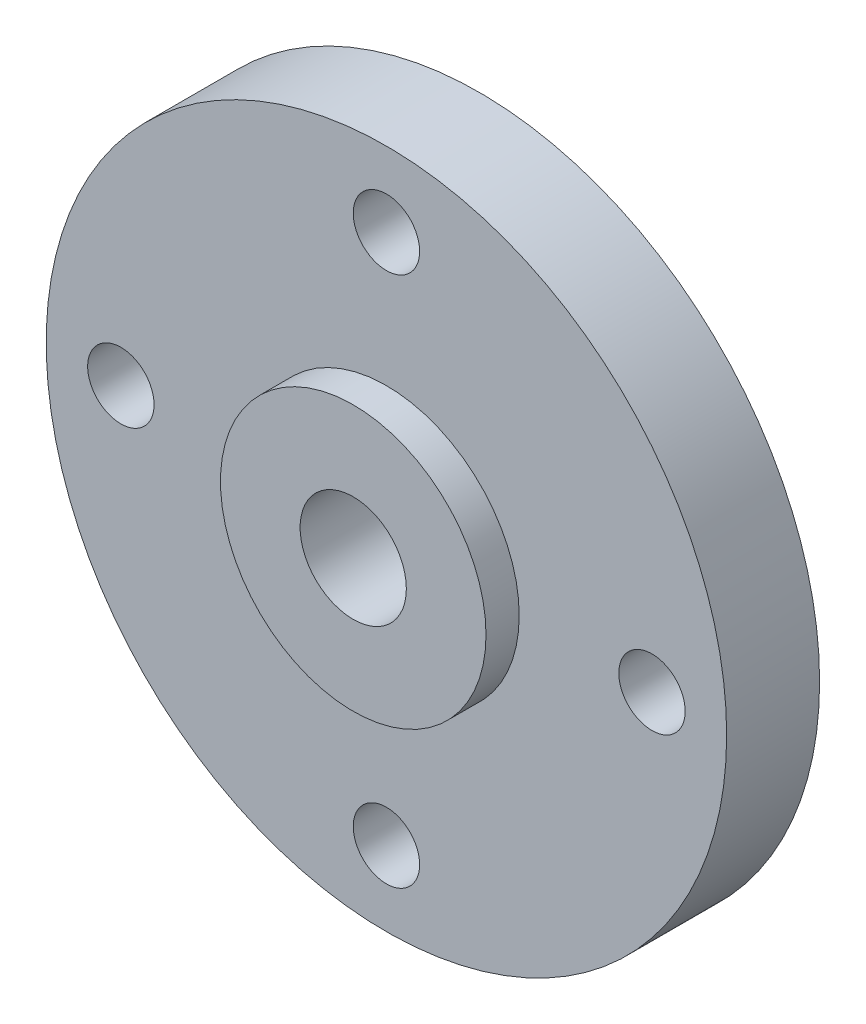
ISO-10303-21;
HEADER;
FILE_DESCRIPTION(('STEP AP214'),'2;1');
FILE_NAME('part.step','',(''),(''),'','','');
FILE_SCHEMA(('AUTOMOTIVE_DESIGN { 1 0 10303 214 1 1 1 1 }'));
ENDSEC;
DATA;
#1=APPLICATION_CONTEXT('core data for automotive mechanical design processes');
#2=APPLICATION_PROTOCOL_DEFINITION('international standard','automotive_design',2000,#1);
#3=PRODUCT_CONTEXT('',#1,'mechanical');
#4=PRODUCT('Part','Part','',(#3));
#5=PRODUCT_RELATED_PRODUCT_CATEGORY('part','',(#4));
#6=PRODUCT_DEFINITION_FORMATION('','',#4);
#7=PRODUCT_DEFINITION_CONTEXT('part definition',#1,'design');
#8=PRODUCT_DEFINITION('design','',#6,#7);
#9=PRODUCT_DEFINITION_SHAPE('','',#8);
#10=(LENGTH_UNIT() NAMED_UNIT(*) SI_UNIT(.MILLI.,.METRE.));
#11=(NAMED_UNIT(*) PLANE_ANGLE_UNIT() SI_UNIT($,.RADIAN.));
#12=(NAMED_UNIT(*) SI_UNIT($,.STERADIAN.) SOLID_ANGLE_UNIT());
#13=UNCERTAINTY_MEASURE_WITH_UNIT(LENGTH_MEASURE(1.E-05),#10,'distance_accuracy_value','');
#14=(GEOMETRIC_REPRESENTATION_CONTEXT(3) GLOBAL_UNCERTAINTY_ASSIGNED_CONTEXT((#13)) GLOBAL_UNIT_ASSIGNED_CONTEXT((#10,
#11,#12)) REPRESENTATION_CONTEXT('',''));
#15=CARTESIAN_POINT('',(0.,0.,0.));
#16=DIRECTION('',(0.,0.,1.));
#17=DIRECTION('',(1.,0.,0.));
#18=AXIS2_PLACEMENT_3D('',#15,#16,#17);
#19=CARTESIAN_POINT('',(0.,0.,2.8));
#20=DIRECTION('',(0.,0.,-1.));
#21=DIRECTION('',(-1.,0.,0.));
#22=AXIS2_PLACEMENT_3D('',#19,#20,#21);
#23=CYLINDRICAL_SURFACE('',#22,10.25);
#24=CARTESIAN_POINT('',(0.,0.,2.8));
#25=DIRECTION('',(0.,0.,1.));
#26=DIRECTION('',(1.,0.,0.));
#27=AXIS2_PLACEMENT_3D('',#24,#25,#26);
#28=CIRCLE('',#27,10.25);
#29=CARTESIAN_POINT('',(10.25,0.,2.8));
#30=VERTEX_POINT('',#29);
#31=EDGE_CURVE('E10',#30,#30,#28,.T.);
#32=ORIENTED_EDGE('',*,*,#31,.F.);
#33=EDGE_LOOP('',(#32));
#34=FACE_BOUND('',#33,.T.);
#35=CARTESIAN_POINT('',(0.,0.,0.));
#36=DIRECTION('',(0.,0.,1.));
#37=DIRECTION('',(1.,0.,0.));
#38=AXIS2_PLACEMENT_3D('',#35,#36,#37);
#39=CIRCLE('',#38,10.25);
#40=CARTESIAN_POINT('',(10.25,0.,0.));
#41=VERTEX_POINT('',#40);
#42=EDGE_CURVE('E39',#41,#41,#39,.T.);
#43=ORIENTED_EDGE('',*,*,#42,.T.);
#44=EDGE_LOOP('',(#43));
#45=FACE_BOUND('',#44,.T.);
#46=ADVANCED_FACE('F36',(#34,#45),#23,.T.);
#47=CARTESIAN_POINT('',(0.,0.,2.8));
#48=DIRECTION('',(0.,0.,1.));
#49=DIRECTION('',(1.,0.,0.));
#50=AXIS2_PLACEMENT_3D('',#47,#48,#49);
#51=PLANE('',#50);
#52=CARTESIAN_POINT('',(0.,8.,2.8));
#53=DIRECTION('',(0.,0.,1.));
#54=DIRECTION('',(1.,0.,0.));
#55=AXIS2_PLACEMENT_3D('',#52,#53,#54);
#56=CIRCLE('',#55,1.);
#57=CARTESIAN_POINT('',(1.,8.,2.8));
#58=VERTEX_POINT('',#57);
#59=EDGE_CURVE('E77',#58,#58,#56,.T.);
#60=ORIENTED_EDGE('',*,*,#59,.F.);
#61=EDGE_LOOP('',(#60));
#62=FACE_BOUND('',#61,.T.);
#63=CARTESIAN_POINT('',(-8.,0.,2.8));
#64=DIRECTION('',(0.,0.,1.));
#65=DIRECTION('',(1.,0.,0.));
#66=AXIS2_PLACEMENT_3D('',#63,#64,#65);
#67=CIRCLE('',#66,1.);
#68=CARTESIAN_POINT('',(-7.,0.,2.8));
#69=VERTEX_POINT('',#68);
#70=EDGE_CURVE('E71',#69,#69,#67,.T.);
#71=ORIENTED_EDGE('',*,*,#70,.F.);
#72=EDGE_LOOP('',(#71));
#73=FACE_BOUND('',#72,.T.);
#74=CARTESIAN_POINT('',(0.,-8.,2.8));
#75=DIRECTION('',(0.,0.,1.));
#76=DIRECTION('',(1.,0.,0.));
#77=AXIS2_PLACEMENT_3D('',#74,#75,#76);
#78=CIRCLE('',#77,1.);
#79=CARTESIAN_POINT('',(1.,-8.,2.8));
#80=VERTEX_POINT('',#79);
#81=EDGE_CURVE('E65',#80,#80,#78,.T.);
#82=ORIENTED_EDGE('',*,*,#81,.F.);
#83=EDGE_LOOP('',(#82));
#84=FACE_BOUND('',#83,.T.);
#85=CARTESIAN_POINT('',(8.,0.,2.8));
#86=DIRECTION('',(0.,0.,1.));
#87=DIRECTION('',(1.,0.,0.));
#88=AXIS2_PLACEMENT_3D('',#85,#86,#87);
#89=CIRCLE('',#88,1.);
#90=CARTESIAN_POINT('',(9.,0.,2.8));
#91=VERTEX_POINT('',#90);
#92=EDGE_CURVE('E59',#91,#91,#89,.T.);
#93=ORIENTED_EDGE('',*,*,#92,.F.);
#94=EDGE_LOOP('',(#93));
#95=FACE_BOUND('',#94,.T.);
#96=CARTESIAN_POINT('',(0.,0.,2.8));
#97=DIRECTION('',(0.,0.,1.));
#98=DIRECTION('',(1.,0.,0.));
#99=AXIS2_PLACEMENT_3D('',#96,#97,#98);
#100=CIRCLE('',#99,4.);
#101=CARTESIAN_POINT('',(4.,0.,2.8));
#102=VERTEX_POINT('',#101);
#103=EDGE_CURVE('E43',#102,#102,#100,.T.);
#104=ORIENTED_EDGE('',*,*,#103,.F.);
#105=EDGE_LOOP('',(#104));
#106=FACE_BOUND('',#105,.T.);
#107=ORIENTED_EDGE('',*,*,#31,.T.);
#108=EDGE_LOOP('',(#107));
#109=FACE_BOUND('',#108,.T.);
#110=ADVANCED_FACE('F93',(#62,#73,#84,#95,#106,#109),#51,.T.);
#111=CARTESIAN_POINT('',(0.,0.,0.));
#112=DIRECTION('',(0.,0.,1.));
#113=DIRECTION('',(1.,0.,0.));
#114=AXIS2_PLACEMENT_3D('',#111,#112,#113);
#115=PLANE('',#114);
#116=CARTESIAN_POINT('',(0.,8.,0.));
#117=DIRECTION('',(0.,0.,1.));
#118=DIRECTION('',(1.,0.,0.));
#119=AXIS2_PLACEMENT_3D('',#116,#117,#118);
#120=CIRCLE('',#119,1.);
#121=CARTESIAN_POINT('',(1.,8.,0.));
#122=VERTEX_POINT('',#121);
#123=EDGE_CURVE('E53',#122,#122,#120,.T.);
#124=ORIENTED_EDGE('',*,*,#123,.T.);
#125=EDGE_LOOP('',(#124));
#126=FACE_BOUND('',#125,.T.);
#127=CARTESIAN_POINT('',(-8.,0.,0.));
#128=DIRECTION('',(0.,0.,1.));
#129=DIRECTION('',(1.,0.,0.));
#130=AXIS2_PLACEMENT_3D('',#127,#128,#129);
#131=CIRCLE('',#130,1.);
#132=CARTESIAN_POINT('',(-7.,0.,0.));
#133=VERTEX_POINT('',#132);
#134=EDGE_CURVE('E74',#133,#133,#131,.T.);
#135=ORIENTED_EDGE('',*,*,#134,.T.);
#136=EDGE_LOOP('',(#135));
#137=FACE_BOUND('',#136,.T.);
#138=CARTESIAN_POINT('',(0.,-8.,0.));
#139=DIRECTION('',(0.,0.,1.));
#140=DIRECTION('',(1.,0.,0.));
#141=AXIS2_PLACEMENT_3D('',#138,#139,#140);
#142=CIRCLE('',#141,1.);
#143=CARTESIAN_POINT('',(1.,-8.,0.));
#144=VERTEX_POINT('',#143);
#145=EDGE_CURVE('E68',#144,#144,#142,.T.);
#146=ORIENTED_EDGE('',*,*,#145,.T.);
#147=EDGE_LOOP('',(#146));
#148=FACE_BOUND('',#147,.T.);
#149=CARTESIAN_POINT('',(8.,0.,0.));
#150=DIRECTION('',(0.,0.,1.));
#151=DIRECTION('',(1.,0.,0.));
#152=AXIS2_PLACEMENT_3D('',#149,#150,#151);
#153=CIRCLE('',#152,1.);
#154=CARTESIAN_POINT('',(9.,0.,0.));
#155=VERTEX_POINT('',#154);
#156=EDGE_CURVE('E62',#155,#155,#153,.T.);
#157=ORIENTED_EDGE('',*,*,#156,.T.);
#158=EDGE_LOOP('',(#157));
#159=FACE_BOUND('',#158,.T.);
#160=ORIENTED_EDGE('',*,*,#42,.F.);
#161=EDGE_LOOP('',(#160));
#162=FACE_BOUND('',#161,.T.);
#163=CARTESIAN_POINT('',(0.,0.,0.));
#164=DIRECTION('',(0.,0.,1.));
#165=DIRECTION('',(1.,0.,0.));
#166=AXIS2_PLACEMENT_3D('',#163,#164,#165);
#167=CIRCLE('',#166,1.6);
#168=CARTESIAN_POINT('',(1.6,0.,0.));
#169=VERTEX_POINT('',#168);
#170=EDGE_CURVE('E49',#169,#169,#167,.T.);
#171=ORIENTED_EDGE('',*,*,#170,.T.);
#172=EDGE_LOOP('',(#171));
#173=FACE_BOUND('',#172,.T.);
#174=ADVANCED_FACE('F83',(#126,#137,#148,#159,#162,#173),#115,.F.);
#175=CARTESIAN_POINT('',(0.,0.,3.8));
#176=DIRECTION('',(0.,0.,-1.));
#177=DIRECTION('',(-1.,0.,0.));
#178=AXIS2_PLACEMENT_3D('',#175,#176,#177);
#179=CYLINDRICAL_SURFACE('',#178,1.6);
#180=CARTESIAN_POINT('',(0.,0.,3.8));
#181=DIRECTION('',(0.,0.,1.));
#182=DIRECTION('',(1.,0.,0.));
#183=AXIS2_PLACEMENT_3D('',#180,#181,#182);
#184=CIRCLE('',#183,1.6);
#185=CARTESIAN_POINT('',(1.6,0.,3.8));
#186=VERTEX_POINT('',#185);
#187=EDGE_CURVE('E52',#186,#186,#184,.T.);
#188=ORIENTED_EDGE('',*,*,#187,.T.);
#189=EDGE_LOOP('',(#188));
#190=FACE_BOUND('',#189,.T.);
#191=ORIENTED_EDGE('',*,*,#170,.F.);
#192=EDGE_LOOP('',(#191));
#193=FACE_BOUND('',#192,.T.);
#194=ADVANCED_FACE('F109',(#190,#193),#179,.F.);
#195=CARTESIAN_POINT('',(0.,0.,3.8));
#196=DIRECTION('',(0.,0.,-1.));
#197=DIRECTION('',(-1.,0.,0.));
#198=AXIS2_PLACEMENT_3D('',#195,#196,#197);
#199=CYLINDRICAL_SURFACE('',#198,4.);
#200=ORIENTED_EDGE('',*,*,#103,.T.);
#201=EDGE_LOOP('',(#200));
#202=FACE_BOUND('',#201,.T.);
#203=CARTESIAN_POINT('',(0.,0.,3.8));
#204=DIRECTION('',(0.,0.,1.));
#205=DIRECTION('',(1.,0.,0.));
#206=AXIS2_PLACEMENT_3D('',#203,#204,#205);
#207=CIRCLE('',#206,4.);
#208=CARTESIAN_POINT('',(4.,0.,3.8));
#209=VERTEX_POINT('',#208);
#210=EDGE_CURVE('E54',#209,#209,#207,.T.);
#211=ORIENTED_EDGE('',*,*,#210,.F.);
#212=EDGE_LOOP('',(#211));
#213=FACE_BOUND('',#212,.T.);
#214=ADVANCED_FACE('F105',(#202,#213),#199,.T.);
#215=CARTESIAN_POINT('',(0.,0.,3.8));
#216=DIRECTION('',(0.,0.,1.));
#217=DIRECTION('',(1.,0.,0.));
#218=AXIS2_PLACEMENT_3D('',#215,#216,#217);
#219=PLANE('',#218);
#220=ORIENTED_EDGE('',*,*,#187,.F.);
#221=EDGE_LOOP('',(#220));
#222=FACE_BOUND('',#221,.T.);
#223=ORIENTED_EDGE('',*,*,#210,.T.);
#224=EDGE_LOOP('',(#223));
#225=FACE_BOUND('',#224,.T.);
#226=ADVANCED_FACE('F108',(#222,#225),#219,.T.);
#227=CARTESIAN_POINT('',(8.,0.,0.));
#228=DIRECTION('',(0.,0.,1.));
#229=DIRECTION('',(1.,0.,0.));
#230=AXIS2_PLACEMENT_3D('',#227,#228,#229);
#231=CYLINDRICAL_SURFACE('',#230,1.);
#232=ORIENTED_EDGE('',*,*,#156,.F.);
#233=EDGE_LOOP('',(#232));
#234=FACE_BOUND('',#233,.T.);
#235=ORIENTED_EDGE('',*,*,#92,.T.);
#236=EDGE_LOOP('',(#235));
#237=FACE_BOUND('',#236,.T.);
#238=ADVANCED_FACE('F114',(#234,#237),#231,.F.);
#239=CARTESIAN_POINT('',(0.,-8.,0.));
#240=DIRECTION('',(0.,0.,1.));
#241=DIRECTION('',(1.,0.,0.));
#242=AXIS2_PLACEMENT_3D('',#239,#240,#241);
#243=CYLINDRICAL_SURFACE('',#242,1.);
#244=ORIENTED_EDGE('',*,*,#145,.F.);
#245=EDGE_LOOP('',(#244));
#246=FACE_BOUND('',#245,.T.);
#247=ORIENTED_EDGE('',*,*,#81,.T.);
#248=EDGE_LOOP('',(#247));
#249=FACE_BOUND('',#248,.T.);
#250=ADVANCED_FACE('F120',(#246,#249),#243,.F.);
#251=CARTESIAN_POINT('',(-8.,0.,0.));
#252=DIRECTION('',(0.,0.,1.));
#253=DIRECTION('',(1.,0.,0.));
#254=AXIS2_PLACEMENT_3D('',#251,#252,#253);
#255=CYLINDRICAL_SURFACE('',#254,1.);
#256=ORIENTED_EDGE('',*,*,#134,.F.);
#257=EDGE_LOOP('',(#256));
#258=FACE_BOUND('',#257,.T.);
#259=ORIENTED_EDGE('',*,*,#70,.T.);
#260=EDGE_LOOP('',(#259));
#261=FACE_BOUND('',#260,.T.);
#262=ADVANCED_FACE('F89',(#258,#261),#255,.F.);
#263=CARTESIAN_POINT('',(0.,8.,0.));
#264=DIRECTION('',(0.,0.,1.));
#265=DIRECTION('',(1.,0.,0.));
#266=AXIS2_PLACEMENT_3D('',#263,#264,#265);
#267=CYLINDRICAL_SURFACE('',#266,1.);
#268=ORIENTED_EDGE('',*,*,#123,.F.);
#269=EDGE_LOOP('',(#268));
#270=FACE_BOUND('',#269,.T.);
#271=ORIENTED_EDGE('',*,*,#59,.T.);
#272=EDGE_LOOP('',(#271));
#273=FACE_BOUND('',#272,.T.);
#274=ADVANCED_FACE('F86',(#270,#273),#267,.F.);
#275=CLOSED_SHELL('',(#46,#110,#174,#194,#214,#226,#238,#250,#262,#274));
#276=MANIFOLD_SOLID_BREP('B2',#275);
#277=ADVANCED_BREP_SHAPE_REPRESENTATION('',(#18,#276),#14);
#278=SHAPE_DEFINITION_REPRESENTATION(#9,#277);
ENDSEC;
END-ISO-10303-21;
